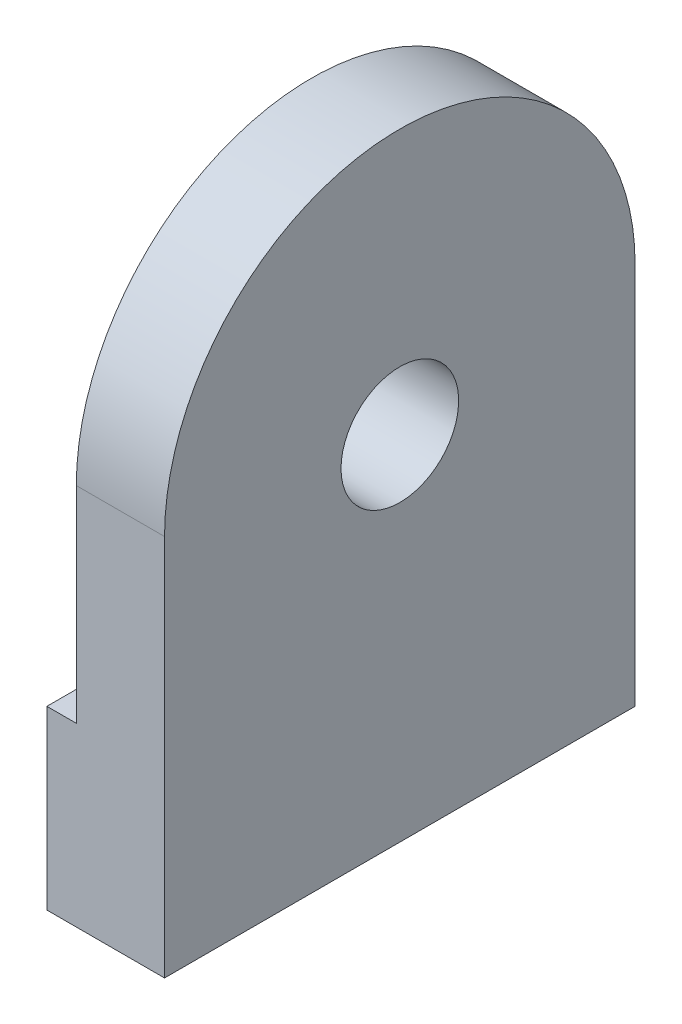
ISO-10303-21;
HEADER;
FILE_DESCRIPTION(('STEP AP214'),'2;1');
FILE_NAME('part.step','',(''),(''),'','','');
FILE_SCHEMA(('AUTOMOTIVE_DESIGN { 1 0 10303 214 1 1 1 1 }'));
ENDSEC;
DATA;
#1=APPLICATION_CONTEXT('core data for automotive mechanical design processes');
#2=APPLICATION_PROTOCOL_DEFINITION('international standard','automotive_design',2000,#1);
#3=PRODUCT_CONTEXT('',#1,'mechanical');
#4=PRODUCT('Part','Part','',(#3));
#5=PRODUCT_RELATED_PRODUCT_CATEGORY('part','',(#4));
#6=PRODUCT_DEFINITION_FORMATION('','',#4);
#7=PRODUCT_DEFINITION_CONTEXT('part definition',#1,'design');
#8=PRODUCT_DEFINITION('design','',#6,#7);
#9=PRODUCT_DEFINITION_SHAPE('','',#8);
#10=(LENGTH_UNIT() NAMED_UNIT(*) SI_UNIT(.MILLI.,.METRE.));
#11=(NAMED_UNIT(*) PLANE_ANGLE_UNIT() SI_UNIT($,.RADIAN.));
#12=(NAMED_UNIT(*) SI_UNIT($,.STERADIAN.) SOLID_ANGLE_UNIT());
#13=UNCERTAINTY_MEASURE_WITH_UNIT(LENGTH_MEASURE(1.E-05),#10,'distance_accuracy_value','');
#14=(GEOMETRIC_REPRESENTATION_CONTEXT(3) GLOBAL_UNCERTAINTY_ASSIGNED_CONTEXT((#13)) GLOBAL_UNIT_ASSIGNED_CONTEXT((#10,
#11,#12)) REPRESENTATION_CONTEXT('',''));
#15=CARTESIAN_POINT('',(0.,0.,0.));
#16=DIRECTION('',(0.,0.,1.));
#17=DIRECTION('',(1.,0.,0.));
#18=AXIS2_PLACEMENT_3D('',#15,#16,#17);
#19=CARTESIAN_POINT('',(0.,6.5,-4.));
#20=DIRECTION('',(-1.,0.,0.));
#21=DIRECTION('',(0.,0.,1.));
#22=AXIS2_PLACEMENT_3D('',#19,#20,#21);
#23=PLANE('',#22);
#24=DIRECTION('',(0.,0.,1.));
#25=VECTOR('',#24,1.);
#26=CARTESIAN_POINT('',(0.,3.,-2.));
#27=LINE('',#26,#25);
#28=CARTESIAN_POINT('',(0.,3.,-2.));
#29=VERTEX_POINT('',#28);
#30=CARTESIAN_POINT('',(0.,3.,0.));
#31=VERTEX_POINT('',#30);
#32=EDGE_CURVE('E135',#29,#31,#27,.T.);
#33=ORIENTED_EDGE('',*,*,#32,.F.);
#34=DIRECTION('',(0.,1.,0.));
#35=VECTOR('',#34,1.);
#36=CARTESIAN_POINT('',(0.,0.,-2.));
#37=LINE('',#36,#35);
#38=CARTESIAN_POINT('',(0.,0.,-2.));
#39=VERTEX_POINT('',#38);
#40=EDGE_CURVE('E183',#39,#29,#37,.T.);
#41=ORIENTED_EDGE('',*,*,#40,.F.);
#42=DIRECTION('',(0.,0.,-1.));
#43=VECTOR('',#42,1.);
#44=CARTESIAN_POINT('',(0.,0.,0.));
#45=LINE('',#44,#43);
#46=CARTESIAN_POINT('',(0.,0.,0.));
#47=VERTEX_POINT('',#46);
#48=EDGE_CURVE('E155',#47,#39,#45,.T.);
#49=ORIENTED_EDGE('',*,*,#48,.F.);
#50=DIRECTION('',(0.,-1.,0.));
#51=VECTOR('',#50,1.);
#52=CARTESIAN_POINT('',(0.,0.,0.));
#53=LINE('',#52,#51);
#54=EDGE_CURVE('E74',#31,#47,#53,.T.);
#55=ORIENTED_EDGE('',*,*,#54,.F.);
#56=EDGE_LOOP('',(#33,#41,#49,#55));
#57=FACE_BOUND('',#56,.T.);
#58=ADVANCED_FACE('F35',(#57),#23,.T.);
#59=CARTESIAN_POINT('',(2.,0.,0.));
#60=DIRECTION('',(0.,1.,0.));
#61=DIRECTION('',(0.,0.,1.));
#62=AXIS2_PLACEMENT_3D('',#59,#60,#61);
#63=PLANE('',#62);
#64=ORIENTED_EDGE('',*,*,#48,.T.);
#65=DIRECTION('',(-1.,0.,0.));
#66=VECTOR('',#65,1.);
#67=CARTESIAN_POINT('',(0.5,0.,-2.));
#68=LINE('',#67,#66);
#69=CARTESIAN_POINT('',(0.5,0.,-2.));
#70=VERTEX_POINT('',#69);
#71=EDGE_CURVE('E196',#70,#39,#68,.T.);
#72=ORIENTED_EDGE('',*,*,#71,.F.);
#73=DIRECTION('',(0.,0.,1.));
#74=VECTOR('',#73,1.);
#75=CARTESIAN_POINT('',(0.5,0.,-6.));
#76=LINE('',#75,#74);
#77=CARTESIAN_POINT('',(0.5,0.,-6.));
#78=VERTEX_POINT('',#77);
#79=EDGE_CURVE('E214',#78,#70,#76,.T.);
#80=ORIENTED_EDGE('',*,*,#79,.F.);
#81=DIRECTION('',(-1.,0.,0.));
#82=VECTOR('',#81,1.);
#83=CARTESIAN_POINT('',(0.5,0.,-6.));
#84=LINE('',#83,#82);
#85=CARTESIAN_POINT('',(0.,0.,-6.));
#86=VERTEX_POINT('',#85);
#87=EDGE_CURVE('E142',#78,#86,#84,.T.);
#88=ORIENTED_EDGE('',*,*,#87,.T.);
#89=CARTESIAN_POINT('',(0.,0.,-8.));
#90=VERTEX_POINT('',#89);
#91=EDGE_CURVE('E158',#86,#90,#45,.T.);
#92=ORIENTED_EDGE('',*,*,#91,.T.);
#93=DIRECTION('',(-1.,0.,0.));
#94=VECTOR('',#93,1.);
#95=CARTESIAN_POINT('',(2.,0.,-8.));
#96=LINE('',#95,#94);
#97=CARTESIAN_POINT('',(2.,0.,-8.));
#98=VERTEX_POINT('',#97);
#99=EDGE_CURVE('E11',#98,#90,#96,.T.);
#100=ORIENTED_EDGE('',*,*,#99,.F.);
#101=DIRECTION('',(0.,0.,-1.));
#102=VECTOR('',#101,1.);
#103=CARTESIAN_POINT('',(2.,0.,0.));
#104=LINE('',#103,#102);
#105=CARTESIAN_POINT('',(2.,0.,0.));
#106=VERTEX_POINT('',#105);
#107=EDGE_CURVE('E148',#106,#98,#104,.T.);
#108=ORIENTED_EDGE('',*,*,#107,.F.);
#109=DIRECTION('',(-1.,0.,0.));
#110=VECTOR('',#109,1.);
#111=CARTESIAN_POINT('',(2.,0.,0.));
#112=LINE('',#111,#110);
#113=EDGE_CURVE('E154',#106,#47,#112,.T.);
#114=ORIENTED_EDGE('',*,*,#113,.T.);
#115=EDGE_LOOP('',(#64,#72,#80,#88,#92,#100,#108,#114));
#116=FACE_BOUND('',#115,.T.);
#117=ADVANCED_FACE('F37',(#116),#63,.F.);
#118=CARTESIAN_POINT('',(2.,6.5,-8.));
#119=DIRECTION('',(0.,0.,1.));
#120=DIRECTION('',(0.,-1.,0.));
#121=AXIS2_PLACEMENT_3D('',#118,#119,#120);
#122=PLANE('',#121);
#123=DIRECTION('',(0.,1.,0.));
#124=VECTOR('',#123,1.);
#125=CARTESIAN_POINT('',(0.,6.5,-8.));
#126=LINE('',#125,#124);
#127=CARTESIAN_POINT('',(0.,3.,-8.));
#128=VERTEX_POINT('',#127);
#129=EDGE_CURVE('E140',#90,#128,#126,.T.);
#130=ORIENTED_EDGE('',*,*,#129,.T.);
#131=DIRECTION('',(-1.,0.,0.));
#132=VECTOR('',#131,1.);
#133=CARTESIAN_POINT('',(0.5,3.,-8.));
#134=LINE('',#133,#132);
#135=CARTESIAN_POINT('',(0.5,3.,-8.));
#136=VERTEX_POINT('',#135);
#137=EDGE_CURVE('E50',#136,#128,#134,.T.);
#138=ORIENTED_EDGE('',*,*,#137,.F.);
#139=DIRECTION('',(0.,-1.,0.));
#140=VECTOR('',#139,1.);
#141=CARTESIAN_POINT('',(0.5,3.,-8.));
#142=LINE('',#141,#140);
#143=CARTESIAN_POINT('',(0.5,6.5,-8.));
#144=VERTEX_POINT('',#143);
#145=EDGE_CURVE('E128',#144,#136,#142,.T.);
#146=ORIENTED_EDGE('',*,*,#145,.F.);
#147=DIRECTION('',(-1.,0.,0.));
#148=VECTOR('',#147,1.);
#149=CARTESIAN_POINT('',(2.,6.5,-8.));
#150=LINE('',#149,#148);
#151=CARTESIAN_POINT('',(2.,6.5,-8.));
#152=VERTEX_POINT('',#151);
#153=EDGE_CURVE('E43',#152,#144,#150,.T.);
#154=ORIENTED_EDGE('',*,*,#153,.F.);
#155=DIRECTION('',(0.,1.,0.));
#156=VECTOR('',#155,1.);
#157=CARTESIAN_POINT('',(2.,6.5,-8.));
#158=LINE('',#157,#156);
#159=EDGE_CURVE('E81',#98,#152,#158,.T.);
#160=ORIENTED_EDGE('',*,*,#159,.F.);
#161=ORIENTED_EDGE('',*,*,#99,.T.);
#162=EDGE_LOOP('',(#130,#138,#146,#154,#160,#161));
#163=FACE_BOUND('',#162,.T.);
#164=ADVANCED_FACE('F138',(#163),#122,.F.);
#165=CARTESIAN_POINT('',(2.,6.5,-4.));
#166=DIRECTION('',(-1.,0.,0.));
#167=DIRECTION('',(0.,0.,1.));
#168=AXIS2_PLACEMENT_3D('',#165,#166,#167);
#169=CYLINDRICAL_SURFACE('',#168,4.);
#170=ORIENTED_EDGE('',*,*,#153,.T.);
#171=CARTESIAN_POINT('',(0.5,6.5,-4.));
#172=DIRECTION('',(-1.,0.,0.));
#173=DIRECTION('',(0.,0.,-1.));
#174=AXIS2_PLACEMENT_3D('',#171,#172,#173);
#175=CIRCLE('',#174,4.);
#176=CARTESIAN_POINT('',(0.5,6.5,0.));
#177=VERTEX_POINT('',#176);
#178=EDGE_CURVE('E133',#177,#144,#175,.T.);
#179=ORIENTED_EDGE('',*,*,#178,.F.);
#180=DIRECTION('',(-1.,0.,0.));
#181=VECTOR('',#180,1.);
#182=CARTESIAN_POINT('',(2.,6.5,0.));
#183=LINE('',#182,#181);
#184=CARTESIAN_POINT('',(2.,6.5,0.));
#185=VERTEX_POINT('',#184);
#186=EDGE_CURVE('E162',#185,#177,#183,.T.);
#187=ORIENTED_EDGE('',*,*,#186,.F.);
#188=CARTESIAN_POINT('',(2.,6.5,-4.));
#189=DIRECTION('',(1.,0.,0.));
#190=DIRECTION('',(0.,0.,1.));
#191=AXIS2_PLACEMENT_3D('',#188,#189,#190);
#192=CIRCLE('',#191,4.);
#193=EDGE_CURVE('E151',#152,#185,#192,.T.);
#194=ORIENTED_EDGE('',*,*,#193,.F.);
#195=EDGE_LOOP('',(#170,#179,#187,#194));
#196=FACE_BOUND('',#195,.T.);
#197=ADVANCED_FACE('F166',(#196),#169,.T.);
#198=CARTESIAN_POINT('',(2.,0.,0.));
#199=DIRECTION('',(0.,0.,-1.));
#200=DIRECTION('',(-1.,0.,0.));
#201=AXIS2_PLACEMENT_3D('',#198,#199,#200);
#202=PLANE('',#201);
#203=DIRECTION('',(0.,1.,0.));
#204=VECTOR('',#203,1.);
#205=CARTESIAN_POINT('',(0.5,3.,0.));
#206=LINE('',#205,#204);
#207=CARTESIAN_POINT('',(0.5,3.,0.));
#208=VERTEX_POINT('',#207);
#209=EDGE_CURVE('E144',#208,#177,#206,.T.);
#210=ORIENTED_EDGE('',*,*,#209,.F.);
#211=DIRECTION('',(-1.,0.,0.));
#212=VECTOR('',#211,1.);
#213=CARTESIAN_POINT('',(0.5,3.,0.));
#214=LINE('',#213,#212);
#215=EDGE_CURVE('E177',#208,#31,#214,.T.);
#216=ORIENTED_EDGE('',*,*,#215,.T.);
#217=ORIENTED_EDGE('',*,*,#54,.T.);
#218=ORIENTED_EDGE('',*,*,#113,.F.);
#219=DIRECTION('',(0.,-1.,0.));
#220=VECTOR('',#219,1.);
#221=CARTESIAN_POINT('',(2.,0.,0.));
#222=LINE('',#221,#220);
#223=EDGE_CURVE('E59',#185,#106,#222,.T.);
#224=ORIENTED_EDGE('',*,*,#223,.F.);
#225=ORIENTED_EDGE('',*,*,#186,.T.);
#226=EDGE_LOOP('',(#210,#216,#217,#218,#224,#225));
#227=FACE_BOUND('',#226,.T.);
#228=ADVANCED_FACE('F208',(#227),#202,.F.);
#229=CARTESIAN_POINT('',(2.,6.5,-4.));
#230=DIRECTION('',(-1.,0.,0.));
#231=DIRECTION('',(0.,0.,1.));
#232=AXIS2_PLACEMENT_3D('',#229,#230,#231);
#233=PLANE('',#232);
#234=CARTESIAN_POINT('',(2.,6.,-4.));
#235=DIRECTION('',(-1.,0.,0.));
#236=DIRECTION('',(0.,0.,1.));
#237=AXIS2_PLACEMENT_3D('',#234,#235,#236);
#238=CIRCLE('',#237,1.);
#239=CARTESIAN_POINT('',(2.,6.,-3.));
#240=VERTEX_POINT('',#239);
#241=EDGE_CURVE('E181',#240,#240,#238,.T.);
#242=ORIENTED_EDGE('',*,*,#241,.T.);
#243=EDGE_LOOP('',(#242));
#244=FACE_BOUND('',#243,.T.);
#245=ORIENTED_EDGE('',*,*,#107,.T.);
#246=ORIENTED_EDGE('',*,*,#159,.T.);
#247=ORIENTED_EDGE('',*,*,#193,.T.);
#248=ORIENTED_EDGE('',*,*,#223,.T.);
#249=EDGE_LOOP('',(#245,#246,#247,#248));
#250=FACE_BOUND('',#249,.T.);
#251=ADVANCED_FACE('F168',(#244,#250),#233,.F.);
#252=DIRECTION('',(0.,-1.,0.));
#253=VECTOR('',#252,1.);
#254=CARTESIAN_POINT('',(0.,3.,-6.));
#255=LINE('',#254,#253);
#256=CARTESIAN_POINT('',(0.,3.,-6.));
#257=VERTEX_POINT('',#256);
#258=EDGE_CURVE('E180',#257,#86,#255,.T.);
#259=ORIENTED_EDGE('',*,*,#258,.F.);
#260=DIRECTION('',(0.,0.,1.));
#261=VECTOR('',#260,1.);
#262=CARTESIAN_POINT('',(0.,3.,-8.));
#263=LINE('',#262,#261);
#264=EDGE_CURVE('E179',#128,#257,#263,.T.);
#265=ORIENTED_EDGE('',*,*,#264,.F.);
#266=ORIENTED_EDGE('',*,*,#129,.F.);
#267=ORIENTED_EDGE('',*,*,#91,.F.);
#268=EDGE_LOOP('',(#259,#265,#266,#267));
#269=FACE_BOUND('',#268,.T.);
#270=ADVANCED_FACE('F178',(#269),#23,.T.);
#271=CARTESIAN_POINT('',(0.5,3.,-2.));
#272=DIRECTION('',(0.,-1.,0.));
#273=DIRECTION('',(0.,0.,-1.));
#274=AXIS2_PLACEMENT_3D('',#271,#272,#273);
#275=PLANE('',#274);
#276=ORIENTED_EDGE('',*,*,#32,.T.);
#277=ORIENTED_EDGE('',*,*,#215,.F.);
#278=DIRECTION('',(0.,0.,1.));
#279=VECTOR('',#278,1.);
#280=CARTESIAN_POINT('',(0.5,3.,-2.));
#281=LINE('',#280,#279);
#282=CARTESIAN_POINT('',(0.5,3.,-2.));
#283=VERTEX_POINT('',#282);
#284=EDGE_CURVE('E210',#283,#208,#281,.T.);
#285=ORIENTED_EDGE('',*,*,#284,.F.);
#286=DIRECTION('',(-1.,0.,0.));
#287=VECTOR('',#286,1.);
#288=CARTESIAN_POINT('',(0.5,3.,-2.));
#289=LINE('',#288,#287);
#290=EDGE_CURVE('E194',#283,#29,#289,.T.);
#291=ORIENTED_EDGE('',*,*,#290,.T.);
#292=EDGE_LOOP('',(#276,#277,#285,#291));
#293=FACE_BOUND('',#292,.T.);
#294=ADVANCED_FACE('F241',(#293),#275,.F.);
#295=CARTESIAN_POINT('',(0.5,0.,-2.));
#296=DIRECTION('',(0.,0.,1.));
#297=DIRECTION('',(1.,0.,0.));
#298=AXIS2_PLACEMENT_3D('',#295,#296,#297);
#299=PLANE('',#298);
#300=ORIENTED_EDGE('',*,*,#40,.T.);
#301=ORIENTED_EDGE('',*,*,#290,.F.);
#302=DIRECTION('',(0.,1.,0.));
#303=VECTOR('',#302,1.);
#304=CARTESIAN_POINT('',(0.5,0.,-2.));
#305=LINE('',#304,#303);
#306=EDGE_CURVE('E203',#70,#283,#305,.T.);
#307=ORIENTED_EDGE('',*,*,#306,.F.);
#308=ORIENTED_EDGE('',*,*,#71,.T.);
#309=EDGE_LOOP('',(#300,#301,#307,#308));
#310=FACE_BOUND('',#309,.T.);
#311=ADVANCED_FACE('F200',(#310),#299,.F.);
#312=CARTESIAN_POINT('',(0.5,3.,-6.));
#313=DIRECTION('',(0.,0.,-1.));
#314=DIRECTION('',(-1.,0.,0.));
#315=AXIS2_PLACEMENT_3D('',#312,#313,#314);
#316=PLANE('',#315);
#317=ORIENTED_EDGE('',*,*,#258,.T.);
#318=ORIENTED_EDGE('',*,*,#87,.F.);
#319=DIRECTION('',(0.,-1.,0.));
#320=VECTOR('',#319,1.);
#321=CARTESIAN_POINT('',(0.5,3.,-6.));
#322=LINE('',#321,#320);
#323=CARTESIAN_POINT('',(0.5,3.,-6.));
#324=VERTEX_POINT('',#323);
#325=EDGE_CURVE('E127',#324,#78,#322,.T.);
#326=ORIENTED_EDGE('',*,*,#325,.F.);
#327=DIRECTION('',(-1.,0.,0.));
#328=VECTOR('',#327,1.);
#329=CARTESIAN_POINT('',(0.5,3.,-6.));
#330=LINE('',#329,#328);
#331=EDGE_CURVE('E123',#324,#257,#330,.T.);
#332=ORIENTED_EDGE('',*,*,#331,.T.);
#333=EDGE_LOOP('',(#317,#318,#326,#332));
#334=FACE_BOUND('',#333,.T.);
#335=ADVANCED_FACE('F230',(#334),#316,.F.);
#336=CARTESIAN_POINT('',(0.5,3.,-8.));
#337=DIRECTION('',(0.,-1.,0.));
#338=DIRECTION('',(0.,0.,-1.));
#339=AXIS2_PLACEMENT_3D('',#336,#337,#338);
#340=PLANE('',#339);
#341=ORIENTED_EDGE('',*,*,#264,.T.);
#342=ORIENTED_EDGE('',*,*,#331,.F.);
#343=DIRECTION('',(0.,0.,1.));
#344=VECTOR('',#343,1.);
#345=CARTESIAN_POINT('',(0.5,3.,-8.));
#346=LINE('',#345,#344);
#347=EDGE_CURVE('E120',#136,#324,#346,.T.);
#348=ORIENTED_EDGE('',*,*,#347,.F.);
#349=ORIENTED_EDGE('',*,*,#137,.T.);
#350=EDGE_LOOP('',(#341,#342,#348,#349));
#351=FACE_BOUND('',#350,.T.);
#352=ADVANCED_FACE('F122',(#351),#340,.F.);
#353=CARTESIAN_POINT('',(0.5,6.5,-4.));
#354=DIRECTION('',(1.,0.,0.));
#355=DIRECTION('',(0.,0.,-1.));
#356=AXIS2_PLACEMENT_3D('',#353,#354,#355);
#357=PLANE('',#356);
#358=CARTESIAN_POINT('',(0.5,6.,-4.));
#359=DIRECTION('',(-1.,0.,0.));
#360=DIRECTION('',(0.,0.,1.));
#361=AXIS2_PLACEMENT_3D('',#358,#359,#360);
#362=CIRCLE('',#361,1.);
#363=CARTESIAN_POINT('',(0.5,6.,-3.));
#364=VERTEX_POINT('',#363);
#365=EDGE_CURVE('E186',#364,#364,#362,.T.);
#366=ORIENTED_EDGE('',*,*,#365,.F.);
#367=EDGE_LOOP('',(#366));
#368=FACE_BOUND('',#367,.T.);
#369=ORIENTED_EDGE('',*,*,#145,.T.);
#370=ORIENTED_EDGE('',*,*,#347,.T.);
#371=ORIENTED_EDGE('',*,*,#325,.T.);
#372=ORIENTED_EDGE('',*,*,#79,.T.);
#373=ORIENTED_EDGE('',*,*,#306,.T.);
#374=ORIENTED_EDGE('',*,*,#284,.T.);
#375=ORIENTED_EDGE('',*,*,#209,.T.);
#376=ORIENTED_EDGE('',*,*,#178,.T.);
#377=EDGE_LOOP('',(#369,#370,#371,#372,#373,#374,#375,#376));
#378=FACE_BOUND('',#377,.T.);
#379=ADVANCED_FACE('F131',(#368,#378),#357,.F.);
#380=CARTESIAN_POINT('',(2.,6.,-4.));
#381=DIRECTION('',(-1.,0.,0.));
#382=DIRECTION('',(0.,0.,1.));
#383=AXIS2_PLACEMENT_3D('',#380,#381,#382);
#384=CYLINDRICAL_SURFACE('',#383,1.);
#385=ORIENTED_EDGE('',*,*,#241,.F.);
#386=EDGE_LOOP('',(#385));
#387=FACE_BOUND('',#386,.T.);
#388=ORIENTED_EDGE('',*,*,#365,.T.);
#389=EDGE_LOOP('',(#388));
#390=FACE_BOUND('',#389,.T.);
#391=ADVANCED_FACE('F220',(#387,#390),#384,.F.);
#392=CLOSED_SHELL('',(#58,#117,#164,#197,#228,#251,#270,#294,#311,#335,#352,#379,#391));
#393=MANIFOLD_SOLID_BREP('B2',#392);
#394=ADVANCED_BREP_SHAPE_REPRESENTATION('',(#18,#393),#14);
#395=SHAPE_DEFINITION_REPRESENTATION(#9,#394);
ENDSEC;
END-ISO-10303-21;
